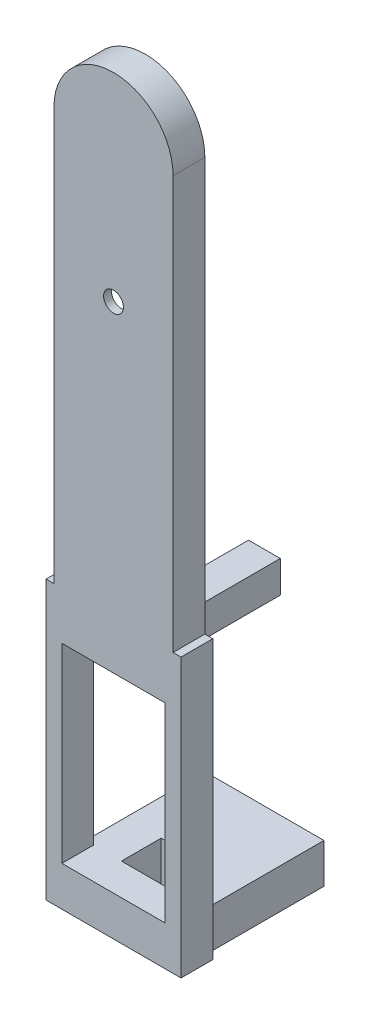
ISO-10303-21;
HEADER;
FILE_DESCRIPTION(('STEP AP214'),'2;1');
FILE_NAME('part.step','',(''),(''),'','','');
FILE_SCHEMA(('AUTOMOTIVE_DESIGN { 1 0 10303 214 1 1 1 1 }'));
ENDSEC;
DATA;
#1=APPLICATION_CONTEXT('core data for automotive mechanical design processes');
#2=APPLICATION_PROTOCOL_DEFINITION('international standard','automotive_design',2000,#1);
#3=PRODUCT_CONTEXT('',#1,'mechanical');
#4=PRODUCT('Part','Part','',(#3));
#5=PRODUCT_RELATED_PRODUCT_CATEGORY('part','',(#4));
#6=PRODUCT_DEFINITION_FORMATION('','',#4);
#7=PRODUCT_DEFINITION_CONTEXT('part definition',#1,'design');
#8=PRODUCT_DEFINITION('design','',#6,#7);
#9=PRODUCT_DEFINITION_SHAPE('','',#8);
#10=(LENGTH_UNIT() NAMED_UNIT(*) SI_UNIT(.MILLI.,.METRE.));
#11=(NAMED_UNIT(*) PLANE_ANGLE_UNIT() SI_UNIT($,.RADIAN.));
#12=(NAMED_UNIT(*) SI_UNIT($,.STERADIAN.) SOLID_ANGLE_UNIT());
#13=UNCERTAINTY_MEASURE_WITH_UNIT(LENGTH_MEASURE(1.E-05),#10,'distance_accuracy_value','');
#14=(GEOMETRIC_REPRESENTATION_CONTEXT(3) GLOBAL_UNCERTAINTY_ASSIGNED_CONTEXT((#13)) GLOBAL_UNIT_ASSIGNED_CONTEXT((#10,
#11,#12)) REPRESENTATION_CONTEXT('',''));
#15=CARTESIAN_POINT('',(0.,0.,0.));
#16=DIRECTION('',(0.,0.,1.));
#17=DIRECTION('',(1.,0.,0.));
#18=AXIS2_PLACEMENT_3D('',#15,#16,#17);
#19=CARTESIAN_POINT('',(0.,52.,0.));
#20=DIRECTION('',(0.,0.,1.));
#21=DIRECTION('',(1.,0.,0.));
#22=AXIS2_PLACEMENT_3D('',#19,#20,#21);
#23=PLANE('',#22);
#24=DIRECTION('',(1.,0.,0.));
#25=VECTOR('',#24,1.);
#26=CARTESIAN_POINT('',(-6.49999999999999,-30.,0.));
#27=LINE('',#26,#25);
#28=CARTESIAN_POINT('',(-3.,-30.,0.));
#29=VERTEX_POINT('',#28);
#30=CARTESIAN_POINT('',(3.,-30.,0.));
#31=VERTEX_POINT('',#30);
#32=EDGE_CURVE('E336',#29,#31,#27,.T.);
#33=ORIENTED_EDGE('',*,*,#32,.T.);
#34=DIRECTION('',(0.,-1.,0.));
#35=VECTOR('',#34,1.);
#36=CARTESIAN_POINT('',(3.,-30.,0.));
#37=LINE('',#36,#35);
#38=CARTESIAN_POINT('',(3.,-35.,0.));
#39=VERTEX_POINT('',#38);
#40=EDGE_CURVE('E257',#31,#39,#37,.T.);
#41=ORIENTED_EDGE('',*,*,#40,.T.);
#42=DIRECTION('',(1.,0.,0.));
#43=VECTOR('',#42,1.);
#44=CARTESIAN_POINT('',(8.50000000000001,-35.,0.));
#45=LINE('',#44,#43);
#46=CARTESIAN_POINT('',(-3.,-35.,0.));
#47=VERTEX_POINT('',#46);
#48=EDGE_CURVE('E392',#47,#39,#45,.T.);
#49=ORIENTED_EDGE('',*,*,#48,.F.);
#50=DIRECTION('',(0.,-1.,0.));
#51=VECTOR('',#50,1.);
#52=CARTESIAN_POINT('',(-3.,-30.,0.));
#53=LINE('',#52,#51);
#54=EDGE_CURVE('E292',#29,#47,#53,.T.);
#55=ORIENTED_EDGE('',*,*,#54,.F.);
#56=EDGE_LOOP('',(#33,#41,#49,#55));
#57=FACE_BOUND('',#56,.T.);
#58=ADVANCED_FACE('F36',(#57),#23,.F.);
#59=DIRECTION('',(-0.161684528353418,0.986842496699009,0.));
#60=VECTOR('',#59,1.);
#61=CARTESIAN_POINT('',(10.3740127119628,1.69968090964537,0.));
#62=LINE('',#61,#60);
#63=CARTESIAN_POINT('',(5.,34.5,0.));
#64=VERTEX_POINT('',#63);
#65=CARTESIAN_POINT('',(2.13279550115704,52.,0.));
#66=VERTEX_POINT('',#65);
#67=EDGE_CURVE('E413',#64,#66,#62,.T.);
#68=ORIENTED_EDGE('',*,*,#67,.T.);
#69=CARTESIAN_POINT('',(0.,52.,0.));
#70=DIRECTION('',(0.,0.,1.));
#71=DIRECTION('',(1.,0.,0.));
#72=AXIS2_PLACEMENT_3D('',#69,#70,#71);
#73=CIRCLE('',#72,2.13279550115703);
#74=CARTESIAN_POINT('',(-2.13279550115703,52.,0.));
#75=VERTEX_POINT('',#74);
#76=EDGE_CURVE('E408',#75,#66,#73,.F.);
#77=ORIENTED_EDGE('',*,*,#76,.F.);
#78=DIRECTION('',(-0.161684528353418,-0.986842496699009,0.));
#79=VECTOR('',#78,1.);
#80=CARTESIAN_POINT('',(-10.3740127119628,1.69968090964537,0.));
#81=LINE('',#80,#79);
#82=CARTESIAN_POINT('',(-5.,34.5,0.));
#83=VERTEX_POINT('',#82);
#84=EDGE_CURVE('E426',#75,#83,#81,.T.);
#85=ORIENTED_EDGE('',*,*,#84,.T.);
#86=DIRECTION('',(0.161167236733303,-0.986927110684346,0.));
#87=VECTOR('',#86,1.);
#88=CARTESIAN_POINT('',(0.617455268354402,0.100831721339679,0.));
#89=LINE('',#88,#87);
#90=CARTESIAN_POINT('',(-2.14221383494361,17.,0.));
#91=VERTEX_POINT('',#90);
#92=EDGE_CURVE('E429',#83,#91,#89,.T.);
#93=ORIENTED_EDGE('',*,*,#92,.T.);
#94=CARTESIAN_POINT('',(0.,17.,0.));
#95=DIRECTION('',(0.,0.,1.));
#96=DIRECTION('',(1.,0.,0.));
#97=AXIS2_PLACEMENT_3D('',#94,#95,#96);
#98=CIRCLE('',#97,2.14221383494361);
#99=CARTESIAN_POINT('',(2.11474128897981,16.6580213525557,0.));
#100=VERTEX_POINT('',#99);
#101=EDGE_CURVE('E432',#91,#100,#98,.T.);
#102=ORIENTED_EDGE('',*,*,#101,.T.);
#103=DIRECTION('',(-0.159637960443524,-0.987175628541057,0.));
#104=VECTOR('',#103,1.);
#105=CARTESIAN_POINT('',(-0.564300677997616,0.091254085603361,0.));
#106=LINE('',#105,#104);
#107=EDGE_CURVE('E435',#64,#100,#106,.T.);
#108=ORIENTED_EDGE('',*,*,#107,.F.);
#109=EDGE_LOOP('',(#68,#77,#85,#93,#102,#108));
#110=FACE_BOUND('',#109,.T.);
#111=DIRECTION('',(0.,-1.,0.));
#112=VECTOR('',#111,1.);
#113=CARTESIAN_POINT('',(7.5,-30.,0.));
#114=LINE('',#113,#112);
#115=CARTESIAN_POINT('',(7.5,-30.,0.));
#116=VERTEX_POINT('',#115);
#117=CARTESIAN_POINT('',(7.5,-35.,0.));
#118=VERTEX_POINT('',#117);
#119=EDGE_CURVE('E53',#116,#118,#114,.T.);
#120=ORIENTED_EDGE('',*,*,#119,.F.);
#121=DIRECTION('',(-1.,0.,0.));
#122=VECTOR('',#121,1.);
#123=CARTESIAN_POINT('',(0.,-30.,0.));
#124=LINE('',#123,#122);
#125=CARTESIAN_POINT('',(6.50000000000001,-30.,0.));
#126=VERTEX_POINT('',#125);
#127=EDGE_CURVE('E261',#116,#126,#124,.T.);
#128=ORIENTED_EDGE('',*,*,#127,.T.);
#129=DIRECTION('',(0.,1.,0.));
#130=VECTOR('',#129,1.);
#131=CARTESIAN_POINT('',(6.50000000000001,-6.,0.));
#132=LINE('',#131,#130);
#133=CARTESIAN_POINT('',(6.50000000000001,-6.,0.));
#134=VERTEX_POINT('',#133);
#135=EDGE_CURVE('E338',#126,#134,#132,.T.);
#136=ORIENTED_EDGE('',*,*,#135,.T.);
#137=DIRECTION('',(-1.,0.,0.));
#138=VECTOR('',#137,1.);
#139=CARTESIAN_POINT('',(-6.49999999999999,-6.,0.));
#140=LINE('',#139,#138);
#141=CARTESIAN_POINT('',(2.00000000000001,-6.00000000000001,0.));
#142=VERTEX_POINT('',#141);
#143=EDGE_CURVE('E342',#134,#142,#140,.T.);
#144=ORIENTED_EDGE('',*,*,#143,.T.);
#145=DIRECTION('',(0.,1.,0.));
#146=VECTOR('',#145,1.);
#147=CARTESIAN_POINT('',(2.00000000000001,-2.00000000000001,0.));
#148=LINE('',#147,#146);
#149=CARTESIAN_POINT('',(2.00000000000001,-2.00000000000001,0.));
#150=VERTEX_POINT('',#149);
#151=EDGE_CURVE('E304',#142,#150,#148,.T.);
#152=ORIENTED_EDGE('',*,*,#151,.T.);
#153=DIRECTION('',(-1.,0.,0.));
#154=VECTOR('',#153,1.);
#155=CARTESIAN_POINT('',(2.00000000000001,-2.00000000000001,0.));
#156=LINE('',#155,#154);
#157=CARTESIAN_POINT('',(-1.99999999999999,-2.00000000000001,0.));
#158=VERTEX_POINT('',#157);
#159=EDGE_CURVE('E322',#150,#158,#156,.T.);
#160=ORIENTED_EDGE('',*,*,#159,.T.);
#161=DIRECTION('',(0.,-1.,0.));
#162=VECTOR('',#161,1.);
#163=CARTESIAN_POINT('',(-1.99999999999999,-2.00000000000001,0.));
#164=LINE('',#163,#162);
#165=CARTESIAN_POINT('',(-1.99999999999999,-6.,0.));
#166=VERTEX_POINT('',#165);
#167=EDGE_CURVE('E310',#158,#166,#164,.T.);
#168=ORIENTED_EDGE('',*,*,#167,.T.);
#169=CARTESIAN_POINT('',(-6.49999999999999,-6.,0.));
#170=VERTEX_POINT('',#169);
#171=EDGE_CURVE('E341',#166,#170,#140,.T.);
#172=ORIENTED_EDGE('',*,*,#171,.T.);
#173=DIRECTION('',(0.,-1.,0.));
#174=VECTOR('',#173,1.);
#175=CARTESIAN_POINT('',(-6.49999999999999,-6.,0.));
#176=LINE('',#175,#174);
#177=CARTESIAN_POINT('',(-6.49999999999999,-30.,0.));
#178=VERTEX_POINT('',#177);
#179=EDGE_CURVE('E329',#170,#178,#176,.T.);
#180=ORIENTED_EDGE('',*,*,#179,.T.);
#181=DIRECTION('',(-1.,0.,0.));
#182=VECTOR('',#181,1.);
#183=CARTESIAN_POINT('',(0.,-30.,0.));
#184=LINE('',#183,#182);
#185=CARTESIAN_POINT('',(-7.5,-30.,0.));
#186=VERTEX_POINT('',#185);
#187=EDGE_CURVE('E60',#178,#186,#184,.T.);
#188=ORIENTED_EDGE('',*,*,#187,.T.);
#189=DIRECTION('',(0.,-1.,0.));
#190=VECTOR('',#189,1.);
#191=CARTESIAN_POINT('',(-7.5,-30.,0.));
#192=LINE('',#191,#190);
#193=CARTESIAN_POINT('',(-7.5,-35.,0.));
#194=VERTEX_POINT('',#193);
#195=EDGE_CURVE('E295',#186,#194,#192,.T.);
#196=ORIENTED_EDGE('',*,*,#195,.T.);
#197=CARTESIAN_POINT('',(-8.49999999999999,-35.,0.));
#198=VERTEX_POINT('',#197);
#199=EDGE_CURVE('E372',#198,#194,#45,.T.);
#200=ORIENTED_EDGE('',*,*,#199,.F.);
#201=DIRECTION('',(0.,-1.,0.));
#202=VECTOR('',#201,1.);
#203=CARTESIAN_POINT('',(-8.49999999999999,0.,0.));
#204=LINE('',#203,#202);
#205=CARTESIAN_POINT('',(-8.49999999999999,0.,0.));
#206=VERTEX_POINT('',#205);
#207=EDGE_CURVE('E387',#206,#198,#204,.T.);
#208=ORIENTED_EDGE('',*,*,#207,.F.);
#209=DIRECTION('',(-1.,0.,0.));
#210=VECTOR('',#209,1.);
#211=CARTESIAN_POINT('',(8.50000000000001,0.,0.));
#212=LINE('',#211,#210);
#213=CARTESIAN_POINT('',(-7.5,0.,0.));
#214=VERTEX_POINT('',#213);
#215=EDGE_CURVE('E383',#214,#206,#212,.T.);
#216=ORIENTED_EDGE('',*,*,#215,.F.);
#217=DIRECTION('',(0.,-1.,0.));
#218=VECTOR('',#217,1.);
#219=CARTESIAN_POINT('',(-7.5,0.,0.));
#220=LINE('',#219,#218);
#221=CARTESIAN_POINT('',(-7.5,52.,0.));
#222=VERTEX_POINT('',#221);
#223=EDGE_CURVE('E456',#222,#214,#220,.T.);
#224=ORIENTED_EDGE('',*,*,#223,.F.);
#225=CARTESIAN_POINT('',(0.,52.,0.));
#226=DIRECTION('',(0.,0.,1.));
#227=DIRECTION('',(1.,0.,0.));
#228=AXIS2_PLACEMENT_3D('',#225,#226,#227);
#229=CIRCLE('',#228,7.5);
#230=CARTESIAN_POINT('',(7.5,52.,0.));
#231=VERTEX_POINT('',#230);
#232=EDGE_CURVE('E462',#231,#222,#229,.T.);
#233=ORIENTED_EDGE('',*,*,#232,.F.);
#234=DIRECTION('',(0.,1.,0.));
#235=VECTOR('',#234,1.);
#236=CARTESIAN_POINT('',(7.5,0.,0.));
#237=LINE('',#236,#235);
#238=CARTESIAN_POINT('',(7.5,0.,0.));
#239=VERTEX_POINT('',#238);
#240=EDGE_CURVE('E452',#239,#231,#237,.T.);
#241=ORIENTED_EDGE('',*,*,#240,.F.);
#242=CARTESIAN_POINT('',(8.50000000000001,0.,0.));
#243=VERTEX_POINT('',#242);
#244=EDGE_CURVE('E384',#243,#239,#212,.T.);
#245=ORIENTED_EDGE('',*,*,#244,.F.);
#246=DIRECTION('',(0.,1.,0.));
#247=VECTOR('',#246,1.);
#248=CARTESIAN_POINT('',(8.50000000000001,0.,0.));
#249=LINE('',#248,#247);
#250=CARTESIAN_POINT('',(8.50000000000001,-35.,0.));
#251=VERTEX_POINT('',#250);
#252=EDGE_CURVE('E367',#251,#243,#249,.T.);
#253=ORIENTED_EDGE('',*,*,#252,.F.);
#254=EDGE_CURVE('E389',#118,#251,#45,.T.);
#255=ORIENTED_EDGE('',*,*,#254,.F.);
#256=EDGE_LOOP('',(#120,#128,#136,#144,#152,#160,#168,#172,#180,#188,#196,#200,#208,#216,#224,
#233,#241,#245,#253,#255));
#257=FACE_BOUND('',#256,.T.);
#258=ADVANCED_FACE('F498',(#110,#257),#23,.F.);
#259=CARTESIAN_POINT('',(0.,52.,4.));
#260=DIRECTION('',(0.,0.,1.));
#261=DIRECTION('',(1.,0.,0.));
#262=AXIS2_PLACEMENT_3D('',#259,#260,#261);
#263=PLANE('',#262);
#264=CARTESIAN_POINT('',(0.,34.5,4.));
#265=DIRECTION('',(0.,0.,1.));
#266=DIRECTION('',(1.,0.,0.));
#267=AXIS2_PLACEMENT_3D('',#264,#265,#266);
#268=CIRCLE('',#267,1.25);
#269=CARTESIAN_POINT('',(1.25,34.5,4.));
#270=VERTEX_POINT('',#269);
#271=EDGE_CURVE('E405',#270,#270,#268,.F.);
#272=ORIENTED_EDGE('',*,*,#271,.T.);
#273=EDGE_LOOP('',(#272));
#274=FACE_BOUND('',#273,.T.);
#275=DIRECTION('',(0.,-1.,0.));
#276=VECTOR('',#275,1.);
#277=CARTESIAN_POINT('',(-7.5,0.,4.));
#278=LINE('',#277,#276);
#279=CARTESIAN_POINT('',(-7.5,52.,4.));
#280=VERTEX_POINT('',#279);
#281=CARTESIAN_POINT('',(-7.5,0.,4.));
#282=VERTEX_POINT('',#281);
#283=EDGE_CURVE('E458',#280,#282,#278,.T.);
#284=ORIENTED_EDGE('',*,*,#283,.T.);
#285=DIRECTION('',(-1.,0.,0.));
#286=VECTOR('',#285,1.);
#287=CARTESIAN_POINT('',(8.50000000000001,0.,4.));
#288=LINE('',#287,#286);
#289=CARTESIAN_POINT('',(-8.49999999999999,0.,4.));
#290=VERTEX_POINT('',#289);
#291=EDGE_CURVE('E371',#282,#290,#288,.T.);
#292=ORIENTED_EDGE('',*,*,#291,.T.);
#293=DIRECTION('',(0.,-1.,0.));
#294=VECTOR('',#293,1.);
#295=CARTESIAN_POINT('',(-8.49999999999999,0.,4.));
#296=LINE('',#295,#294);
#297=CARTESIAN_POINT('',(-8.49999999999999,-35.,4.));
#298=VERTEX_POINT('',#297);
#299=EDGE_CURVE('E376',#290,#298,#296,.T.);
#300=ORIENTED_EDGE('',*,*,#299,.T.);
#301=DIRECTION('',(1.,0.,0.));
#302=VECTOR('',#301,1.);
#303=CARTESIAN_POINT('',(8.50000000000001,-35.,4.));
#304=LINE('',#303,#302);
#305=CARTESIAN_POINT('',(8.50000000000001,-35.,4.));
#306=VERTEX_POINT('',#305);
#307=EDGE_CURVE('E378',#298,#306,#304,.T.);
#308=ORIENTED_EDGE('',*,*,#307,.T.);
#309=DIRECTION('',(0.,1.,0.));
#310=VECTOR('',#309,1.);
#311=CARTESIAN_POINT('',(8.50000000000001,0.,4.));
#312=LINE('',#311,#310);
#313=CARTESIAN_POINT('',(8.50000000000001,0.,4.));
#314=VERTEX_POINT('',#313);
#315=EDGE_CURVE('E368',#306,#314,#312,.T.);
#316=ORIENTED_EDGE('',*,*,#315,.T.);
#317=CARTESIAN_POINT('',(7.5,0.,4.));
#318=VERTEX_POINT('',#317);
#319=EDGE_CURVE('E373',#314,#318,#288,.T.);
#320=ORIENTED_EDGE('',*,*,#319,.T.);
#321=DIRECTION('',(0.,1.,0.));
#322=VECTOR('',#321,1.);
#323=CARTESIAN_POINT('',(7.5,0.,4.));
#324=LINE('',#323,#322);
#325=CARTESIAN_POINT('',(7.5,52.,4.));
#326=VERTEX_POINT('',#325);
#327=EDGE_CURVE('E453',#318,#326,#324,.T.);
#328=ORIENTED_EDGE('',*,*,#327,.T.);
#329=CARTESIAN_POINT('',(0.,52.,4.));
#330=DIRECTION('',(0.,0.,1.));
#331=DIRECTION('',(1.,0.,0.));
#332=AXIS2_PLACEMENT_3D('',#329,#330,#331);
#333=CIRCLE('',#332,7.5);
#334=EDGE_CURVE('E455',#326,#280,#333,.T.);
#335=ORIENTED_EDGE('',*,*,#334,.T.);
#336=EDGE_LOOP('',(#284,#292,#300,#308,#316,#320,#328,#335));
#337=FACE_BOUND('',#336,.T.);
#338=DIRECTION('',(-1.,0.,0.));
#339=VECTOR('',#338,1.);
#340=CARTESIAN_POINT('',(0.,-30.,4.));
#341=LINE('',#340,#339);
#342=CARTESIAN_POINT('',(6.50000000000001,-30.,4.));
#343=VERTEX_POINT('',#342);
#344=CARTESIAN_POINT('',(-6.49999999999999,-30.,4.));
#345=VERTEX_POINT('',#344);
#346=EDGE_CURVE('E361',#343,#345,#341,.T.);
#347=ORIENTED_EDGE('',*,*,#346,.T.);
#348=DIRECTION('',(0.,1.,0.));
#349=VECTOR('',#348,1.);
#350=CARTESIAN_POINT('',(-6.5,52.,4.));
#351=LINE('',#350,#349);
#352=CARTESIAN_POINT('',(-6.49999999999999,-6.,4.));
#353=VERTEX_POINT('',#352);
#354=EDGE_CURVE('E364',#345,#353,#351,.T.);
#355=ORIENTED_EDGE('',*,*,#354,.T.);
#356=DIRECTION('',(1.,0.,0.));
#357=VECTOR('',#356,1.);
#358=CARTESIAN_POINT('',(0.,-6.,4.));
#359=LINE('',#358,#357);
#360=CARTESIAN_POINT('',(6.50000000000001,-6.,4.));
#361=VERTEX_POINT('',#360);
#362=EDGE_CURVE('E355',#353,#361,#359,.T.);
#363=ORIENTED_EDGE('',*,*,#362,.T.);
#364=DIRECTION('',(0.,-1.,0.));
#365=VECTOR('',#364,1.);
#366=CARTESIAN_POINT('',(6.5,52.,4.));
#367=LINE('',#366,#365);
#368=EDGE_CURVE('E358',#361,#343,#367,.T.);
#369=ORIENTED_EDGE('',*,*,#368,.T.);
#370=EDGE_LOOP('',(#347,#355,#363,#369));
#371=FACE_BOUND('',#370,.T.);
#372=ADVANCED_FACE('F529',(#274,#337,#371),#263,.T.);
#373=CARTESIAN_POINT('',(7.5,0.,4.));
#374=DIRECTION('',(-1.,0.,0.));
#375=DIRECTION('',(0.,0.,1.));
#376=AXIS2_PLACEMENT_3D('',#373,#374,#375);
#377=PLANE('',#376);
#378=ORIENTED_EDGE('',*,*,#240,.T.);
#379=DIRECTION('',(0.,0.,-1.));
#380=VECTOR('',#379,1.);
#381=CARTESIAN_POINT('',(7.5,52.,4.));
#382=LINE('',#381,#380);
#383=EDGE_CURVE('E470',#326,#231,#382,.T.);
#384=ORIENTED_EDGE('',*,*,#383,.F.);
#385=ORIENTED_EDGE('',*,*,#327,.F.);
#386=DIRECTION('',(0.,0.,-1.));
#387=VECTOR('',#386,1.);
#388=CARTESIAN_POINT('',(7.5,0.,4.));
#389=LINE('',#388,#387);
#390=EDGE_CURVE('E45',#318,#239,#389,.T.);
#391=ORIENTED_EDGE('',*,*,#390,.T.);
#392=EDGE_LOOP('',(#378,#384,#385,#391));
#393=FACE_BOUND('',#392,.T.);
#394=ADVANCED_FACE('F38',(#393),#377,.F.);
#395=CARTESIAN_POINT('',(0.,52.,4.));
#396=DIRECTION('',(0.,0.,-1.));
#397=DIRECTION('',(-1.,0.,0.));
#398=AXIS2_PLACEMENT_3D('',#395,#396,#397);
#399=CYLINDRICAL_SURFACE('',#398,7.5);
#400=ORIENTED_EDGE('',*,*,#232,.T.);
#401=DIRECTION('',(0.,0.,-1.));
#402=VECTOR('',#401,1.);
#403=CARTESIAN_POINT('',(-7.5,52.,4.));
#404=LINE('',#403,#402);
#405=EDGE_CURVE('E467',#280,#222,#404,.T.);
#406=ORIENTED_EDGE('',*,*,#405,.F.);
#407=ORIENTED_EDGE('',*,*,#334,.F.);
#408=ORIENTED_EDGE('',*,*,#383,.T.);
#409=EDGE_LOOP('',(#400,#406,#407,#408));
#410=FACE_BOUND('',#409,.T.);
#411=ADVANCED_FACE('F713',(#410),#399,.T.);
#412=CARTESIAN_POINT('',(-7.5,0.,4.));
#413=DIRECTION('',(1.,0.,0.));
#414=DIRECTION('',(0.,0.,-1.));
#415=AXIS2_PLACEMENT_3D('',#412,#413,#414);
#416=PLANE('',#415);
#417=ORIENTED_EDGE('',*,*,#223,.T.);
#418=DIRECTION('',(0.,0.,-1.));
#419=VECTOR('',#418,1.);
#420=CARTESIAN_POINT('',(-7.5,0.,4.));
#421=LINE('',#420,#419);
#422=EDGE_CURVE('E460',#282,#214,#421,.T.);
#423=ORIENTED_EDGE('',*,*,#422,.F.);
#424=ORIENTED_EDGE('',*,*,#283,.F.);
#425=ORIENTED_EDGE('',*,*,#405,.T.);
#426=EDGE_LOOP('',(#417,#423,#424,#425));
#427=FACE_BOUND('',#426,.T.);
#428=ADVANCED_FACE('F520',(#427),#416,.F.);
#429=CARTESIAN_POINT('',(0.,52.,3.));
#430=DIRECTION('',(0.,0.,-1.));
#431=DIRECTION('',(-1.,0.,0.));
#432=AXIS2_PLACEMENT_3D('',#429,#430,#431);
#433=CYLINDRICAL_SURFACE('',#432,2.13279550115703);
#434=ORIENTED_EDGE('',*,*,#76,.T.);
#435=DIRECTION('',(0.,0.,-1.));
#436=VECTOR('',#435,1.);
#437=CARTESIAN_POINT('',(2.13279550115704,52.,3.));
#438=LINE('',#437,#436);
#439=CARTESIAN_POINT('',(2.13279550115704,52.,3.));
#440=VERTEX_POINT('',#439);
#441=EDGE_CURVE('E424',#440,#66,#438,.T.);
#442=ORIENTED_EDGE('',*,*,#441,.F.);
#443=CARTESIAN_POINT('',(0.,52.,3.));
#444=DIRECTION('',(0.,0.,1.));
#445=DIRECTION('',(1.,0.,0.));
#446=AXIS2_PLACEMENT_3D('',#443,#444,#445);
#447=CIRCLE('',#446,2.13279550115703);
#448=CARTESIAN_POINT('',(-2.13279550115703,52.,3.));
#449=VERTEX_POINT('',#448);
#450=EDGE_CURVE('E409',#449,#440,#447,.F.);
#451=ORIENTED_EDGE('',*,*,#450,.F.);
#452=DIRECTION('',(0.,0.,-1.));
#453=VECTOR('',#452,1.);
#454=CARTESIAN_POINT('',(-2.13279550115703,52.,3.));
#455=LINE('',#454,#453);
#456=EDGE_CURVE('E450',#449,#75,#455,.T.);
#457=ORIENTED_EDGE('',*,*,#456,.T.);
#458=EDGE_LOOP('',(#434,#442,#451,#457));
#459=FACE_BOUND('',#458,.T.);
#460=ADVANCED_FACE('F491',(#459),#433,.F.);
#461=CARTESIAN_POINT('',(-10.3740127119628,1.69968090964537,3.));
#462=DIRECTION('',(0.986842496699008,-0.161684528353418,0.));
#463=DIRECTION('',(0.161684528353418,0.986842496699009,0.));
#464=AXIS2_PLACEMENT_3D('',#461,#462,#463);
#465=PLANE('',#464);
#466=ORIENTED_EDGE('',*,*,#84,.F.);
#467=ORIENTED_EDGE('',*,*,#456,.F.);
#468=DIRECTION('',(-0.161684528353418,-0.986842496699009,0.));
#469=VECTOR('',#468,1.);
#470=CARTESIAN_POINT('',(-10.3740127119628,1.69968090964537,3.));
#471=LINE('',#470,#469);
#472=CARTESIAN_POINT('',(-5.,34.5,3.));
#473=VERTEX_POINT('',#472);
#474=EDGE_CURVE('E412',#449,#473,#471,.T.);
#475=ORIENTED_EDGE('',*,*,#474,.T.);
#476=DIRECTION('',(0.,0.,-1.));
#477=VECTOR('',#476,1.);
#478=CARTESIAN_POINT('',(-5.,34.5,3.));
#479=LINE('',#478,#477);
#480=EDGE_CURVE('E448',#473,#83,#479,.T.);
#481=ORIENTED_EDGE('',*,*,#480,.T.);
#482=EDGE_LOOP('',(#466,#467,#475,#481));
#483=FACE_BOUND('',#482,.T.);
#484=ADVANCED_FACE('F512',(#483),#465,.T.);
#485=CARTESIAN_POINT('',(0.617455268354402,0.100831721339679,3.));
#486=DIRECTION('',(0.986927110684346,0.161167236733303,0.));
#487=DIRECTION('',(-0.161167236733303,0.986927110684346,0.));
#488=AXIS2_PLACEMENT_3D('',#485,#486,#487);
#489=PLANE('',#488);
#490=ORIENTED_EDGE('',*,*,#92,.F.);
#491=ORIENTED_EDGE('',*,*,#480,.F.);
#492=DIRECTION('',(0.161167236733303,-0.986927110684346,0.));
#493=VECTOR('',#492,1.);
#494=CARTESIAN_POINT('',(0.617455268354402,0.100831721339679,3.));
#495=LINE('',#494,#493);
#496=CARTESIAN_POINT('',(-2.14221383494361,17.,3.));
#497=VERTEX_POINT('',#496);
#498=EDGE_CURVE('E415',#473,#497,#495,.T.);
#499=ORIENTED_EDGE('',*,*,#498,.T.);
#500=DIRECTION('',(0.,0.,-1.));
#501=VECTOR('',#500,1.);
#502=CARTESIAN_POINT('',(-2.14221383494361,17.,3.));
#503=LINE('',#502,#501);
#504=EDGE_CURVE('E446',#497,#91,#503,.T.);
#505=ORIENTED_EDGE('',*,*,#504,.T.);
#506=EDGE_LOOP('',(#490,#491,#499,#505));
#507=FACE_BOUND('',#506,.T.);
#508=ADVANCED_FACE('F509',(#507),#489,.T.);
#509=CARTESIAN_POINT('',(0.,17.,3.));
#510=DIRECTION('',(0.,0.,-1.));
#511=DIRECTION('',(-1.,0.,0.));
#512=AXIS2_PLACEMENT_3D('',#509,#510,#511);
#513=CYLINDRICAL_SURFACE('',#512,2.14221383494361);
#514=ORIENTED_EDGE('',*,*,#101,.F.);
#515=ORIENTED_EDGE('',*,*,#504,.F.);
#516=CARTESIAN_POINT('',(0.,17.,3.));
#517=DIRECTION('',(0.,0.,1.));
#518=DIRECTION('',(1.,0.,0.));
#519=AXIS2_PLACEMENT_3D('',#516,#517,#518);
#520=CIRCLE('',#519,2.14221383494361);
#521=CARTESIAN_POINT('',(2.11474128897981,16.6580213525557,3.));
#522=VERTEX_POINT('',#521);
#523=EDGE_CURVE('E417',#497,#522,#520,.T.);
#524=ORIENTED_EDGE('',*,*,#523,.T.);
#525=DIRECTION('',(0.,0.,-1.));
#526=VECTOR('',#525,1.);
#527=CARTESIAN_POINT('',(2.11474128897981,16.6580213525557,3.));
#528=LINE('',#527,#526);
#529=EDGE_CURVE('E444',#522,#100,#528,.T.);
#530=ORIENTED_EDGE('',*,*,#529,.T.);
#531=EDGE_LOOP('',(#514,#515,#524,#530));
#532=FACE_BOUND('',#531,.T.);
#533=ADVANCED_FACE('F506',(#532),#513,.F.);
#534=CARTESIAN_POINT('',(-0.564300677997616,0.091254085603361,3.));
#535=DIRECTION('',(0.987175628541057,-0.159637960443524,0.));
#536=DIRECTION('',(0.159637960443524,0.987175628541057,0.));
#537=AXIS2_PLACEMENT_3D('',#534,#535,#536);
#538=PLANE('',#537);
#539=ORIENTED_EDGE('',*,*,#107,.T.);
#540=ORIENTED_EDGE('',*,*,#529,.F.);
#541=DIRECTION('',(-0.159637960443524,-0.987175628541057,0.));
#542=VECTOR('',#541,1.);
#543=CARTESIAN_POINT('',(-0.564300677997616,0.091254085603361,3.));
#544=LINE('',#543,#542);
#545=CARTESIAN_POINT('',(5.,34.5,3.));
#546=VERTEX_POINT('',#545);
#547=EDGE_CURVE('E419',#546,#522,#544,.T.);
#548=ORIENTED_EDGE('',*,*,#547,.F.);
#549=DIRECTION('',(0.,0.,-1.));
#550=VECTOR('',#549,1.);
#551=CARTESIAN_POINT('',(5.,34.5,3.));
#552=LINE('',#551,#550);
#553=EDGE_CURVE('E442',#546,#64,#552,.T.);
#554=ORIENTED_EDGE('',*,*,#553,.T.);
#555=EDGE_LOOP('',(#539,#540,#548,#554));
#556=FACE_BOUND('',#555,.T.);
#557=ADVANCED_FACE('F502',(#556),#538,.F.);
#558=CARTESIAN_POINT('',(10.3740127119628,1.69968090964537,3.));
#559=DIRECTION('',(-0.986842496699008,-0.161684528353418,0.));
#560=DIRECTION('',(0.161684528353418,-0.986842496699009,0.));
#561=AXIS2_PLACEMENT_3D('',#558,#559,#560);
#562=PLANE('',#561);
#563=ORIENTED_EDGE('',*,*,#67,.F.);
#564=ORIENTED_EDGE('',*,*,#553,.F.);
#565=DIRECTION('',(-0.161684528353418,0.986842496699009,0.));
#566=VECTOR('',#565,1.);
#567=CARTESIAN_POINT('',(10.3740127119628,1.69968090964537,3.));
#568=LINE('',#567,#566);
#569=EDGE_CURVE('E422',#546,#440,#568,.T.);
#570=ORIENTED_EDGE('',*,*,#569,.T.);
#571=ORIENTED_EDGE('',*,*,#441,.T.);
#572=EDGE_LOOP('',(#563,#564,#570,#571));
#573=FACE_BOUND('',#572,.T.);
#574=ADVANCED_FACE('F482',(#573),#562,.T.);
#575=CARTESIAN_POINT('',(0.,0.,3.));
#576=DIRECTION('',(0.,0.,1.));
#577=DIRECTION('',(1.,0.,0.));
#578=AXIS2_PLACEMENT_3D('',#575,#576,#577);
#579=PLANE('',#578);
#580=CARTESIAN_POINT('',(0.,34.5,3.));
#581=DIRECTION('',(0.,0.,1.));
#582=DIRECTION('',(1.,0.,0.));
#583=AXIS2_PLACEMENT_3D('',#580,#581,#582);
#584=CIRCLE('',#583,1.25);
#585=CARTESIAN_POINT('',(1.25,34.5,3.));
#586=VERTEX_POINT('',#585);
#587=EDGE_CURVE('E404',#586,#586,#584,.F.);
#588=ORIENTED_EDGE('',*,*,#587,.F.);
#589=EDGE_LOOP('',(#588));
#590=FACE_BOUND('',#589,.T.);
#591=ORIENTED_EDGE('',*,*,#450,.T.);
#592=ORIENTED_EDGE('',*,*,#569,.F.);
#593=ORIENTED_EDGE('',*,*,#547,.T.);
#594=ORIENTED_EDGE('',*,*,#523,.F.);
#595=ORIENTED_EDGE('',*,*,#498,.F.);
#596=ORIENTED_EDGE('',*,*,#474,.F.);
#597=EDGE_LOOP('',(#591,#592,#593,#594,#595,#596));
#598=FACE_BOUND('',#597,.T.);
#599=ADVANCED_FACE('F479',(#590,#598),#579,.F.);
#600=CARTESIAN_POINT('',(0.,34.5,12.4));
#601=DIRECTION('',(0.,0.,-1.));
#602=DIRECTION('',(-1.,0.,0.));
#603=AXIS2_PLACEMENT_3D('',#600,#601,#602);
#604=CYLINDRICAL_SURFACE('',#603,1.25);
#605=ORIENTED_EDGE('',*,*,#271,.F.);
#606=EDGE_LOOP('',(#605));
#607=FACE_BOUND('',#606,.T.);
#608=ORIENTED_EDGE('',*,*,#587,.T.);
#609=EDGE_LOOP('',(#608));
#610=FACE_BOUND('',#609,.T.);
#611=ADVANCED_FACE('F477',(#607,#610),#604,.F.);
#612=CARTESIAN_POINT('',(8.50000000000001,0.,4.));
#613=DIRECTION('',(0.,-1.,0.));
#614=DIRECTION('',(1.,0.,0.));
#615=AXIS2_PLACEMENT_3D('',#612,#613,#614);
#616=PLANE('',#615);
#617=ORIENTED_EDGE('',*,*,#291,.F.);
#618=ORIENTED_EDGE('',*,*,#422,.T.);
#619=ORIENTED_EDGE('',*,*,#215,.T.);
#620=DIRECTION('',(0.,0.,-1.));
#621=VECTOR('',#620,1.);
#622=CARTESIAN_POINT('',(-8.49999999999999,0.,4.));
#623=LINE('',#622,#621);
#624=EDGE_CURVE('E398',#290,#206,#623,.T.);
#625=ORIENTED_EDGE('',*,*,#624,.F.);
#626=EDGE_LOOP('',(#617,#618,#619,#625));
#627=FACE_BOUND('',#626,.T.);
#628=ADVANCED_FACE('F594',(#627),#616,.F.);
#629=CARTESIAN_POINT('',(8.50000000000001,0.,4.));
#630=DIRECTION('',(-1.,0.,0.));
#631=DIRECTION('',(0.,-1.,0.));
#632=AXIS2_PLACEMENT_3D('',#629,#630,#631);
#633=PLANE('',#632);
#634=ORIENTED_EDGE('',*,*,#252,.T.);
#635=DIRECTION('',(0.,0.,-1.));
#636=VECTOR('',#635,1.);
#637=CARTESIAN_POINT('',(8.50000000000001,0.,4.));
#638=LINE('',#637,#636);
#639=EDGE_CURVE('E401',#314,#243,#638,.T.);
#640=ORIENTED_EDGE('',*,*,#639,.F.);
#641=ORIENTED_EDGE('',*,*,#315,.F.);
#642=DIRECTION('',(0.,0.,-1.));
#643=VECTOR('',#642,1.);
#644=CARTESIAN_POINT('',(8.50000000000001,-35.,4.));
#645=LINE('',#644,#643);
#646=EDGE_CURVE('E380',#306,#251,#645,.T.);
#647=ORIENTED_EDGE('',*,*,#646,.T.);
#648=EDGE_LOOP('',(#634,#640,#641,#647));
#649=FACE_BOUND('',#648,.T.);
#650=ADVANCED_FACE('F592',(#649),#633,.F.);
#651=ORIENTED_EDGE('',*,*,#390,.F.);
#652=ORIENTED_EDGE('',*,*,#319,.F.);
#653=ORIENTED_EDGE('',*,*,#639,.T.);
#654=ORIENTED_EDGE('',*,*,#244,.T.);
#655=EDGE_LOOP('',(#651,#652,#653,#654));
#656=FACE_BOUND('',#655,.T.);
#657=ADVANCED_FACE('F588',(#656),#616,.F.);
#658=CARTESIAN_POINT('',(-8.49999999999999,0.,4.));
#659=DIRECTION('',(1.,0.,0.));
#660=DIRECTION('',(0.,1.,0.));
#661=AXIS2_PLACEMENT_3D('',#658,#659,#660);
#662=PLANE('',#661);
#663=ORIENTED_EDGE('',*,*,#207,.T.);
#664=DIRECTION('',(0.,0.,-1.));
#665=VECTOR('',#664,1.);
#666=CARTESIAN_POINT('',(-8.49999999999999,-35.,4.));
#667=LINE('',#666,#665);
#668=EDGE_CURVE('E395',#298,#198,#667,.T.);
#669=ORIENTED_EDGE('',*,*,#668,.F.);
#670=ORIENTED_EDGE('',*,*,#299,.F.);
#671=ORIENTED_EDGE('',*,*,#624,.T.);
#672=EDGE_LOOP('',(#663,#669,#670,#671));
#673=FACE_BOUND('',#672,.T.);
#674=ADVANCED_FACE('F584',(#673),#662,.F.);
#675=CARTESIAN_POINT('',(8.50000000000001,-35.,4.));
#676=DIRECTION('',(0.,1.,0.));
#677=DIRECTION('',(0.,0.,1.));
#678=AXIS2_PLACEMENT_3D('',#675,#676,#677);
#679=PLANE('',#678);
#680=ORIENTED_EDGE('',*,*,#48,.T.);
#681=DIRECTION('',(0.,0.,-1.));
#682=VECTOR('',#681,1.);
#683=CARTESIAN_POINT('',(3.,-35.,0.));
#684=LINE('',#683,#682);
#685=CARTESIAN_POINT('',(3.,-35.,-5.));
#686=VERTEX_POINT('',#685);
#687=EDGE_CURVE('E278',#39,#686,#684,.T.);
#688=ORIENTED_EDGE('',*,*,#687,.T.);
#689=DIRECTION('',(1.,0.,0.));
#690=VECTOR('',#689,1.);
#691=CARTESIAN_POINT('',(0.,-35.,-5.));
#692=LINE('',#691,#690);
#693=CARTESIAN_POINT('',(-3.,-35.,-5.));
#694=VERTEX_POINT('',#693);
#695=EDGE_CURVE('E252',#694,#686,#692,.T.);
#696=ORIENTED_EDGE('',*,*,#695,.F.);
#697=DIRECTION('',(0.,0.,-1.));
#698=VECTOR('',#697,1.);
#699=CARTESIAN_POINT('',(-3.,-35.,0.));
#700=LINE('',#699,#698);
#701=EDGE_CURVE('E246',#47,#694,#700,.T.);
#702=ORIENTED_EDGE('',*,*,#701,.F.);
#703=EDGE_LOOP('',(#680,#688,#696,#702));
#704=FACE_BOUND('',#703,.T.);
#705=ORIENTED_EDGE('',*,*,#199,.T.);
#706=DIRECTION('',(0.,0.,-1.));
#707=VECTOR('',#706,1.);
#708=CARTESIAN_POINT('',(-7.5,-35.,0.));
#709=LINE('',#708,#707);
#710=CARTESIAN_POINT('',(-7.5,-35.,-15.));
#711=VERTEX_POINT('',#710);
#712=EDGE_CURVE('E287',#194,#711,#709,.T.);
#713=ORIENTED_EDGE('',*,*,#712,.T.);
#714=DIRECTION('',(1.,0.,0.));
#715=VECTOR('',#714,1.);
#716=CARTESIAN_POINT('',(0.,-35.,-15.));
#717=LINE('',#716,#715);
#718=CARTESIAN_POINT('',(7.5,-35.,-15.));
#719=VERTEX_POINT('',#718);
#720=EDGE_CURVE('E284',#711,#719,#717,.T.);
#721=ORIENTED_EDGE('',*,*,#720,.T.);
#722=DIRECTION('',(0.,0.,-1.));
#723=VECTOR('',#722,1.);
#724=CARTESIAN_POINT('',(7.5,-35.,0.));
#725=LINE('',#724,#723);
#726=EDGE_CURVE('E281',#118,#719,#725,.T.);
#727=ORIENTED_EDGE('',*,*,#726,.F.);
#728=ORIENTED_EDGE('',*,*,#254,.T.);
#729=ORIENTED_EDGE('',*,*,#646,.F.);
#730=ORIENTED_EDGE('',*,*,#307,.F.);
#731=ORIENTED_EDGE('',*,*,#668,.T.);
#732=EDGE_LOOP('',(#705,#713,#721,#727,#728,#729,#730,#731));
#733=FACE_BOUND('',#732,.T.);
#734=ADVANCED_FACE('F580',(#704,#733),#679,.F.);
#735=CARTESIAN_POINT('',(-6.49999999999999,-6.,12.1));
#736=DIRECTION('',(1.,0.,0.));
#737=DIRECTION('',(0.,1.,0.));
#738=AXIS2_PLACEMENT_3D('',#735,#736,#737);
#739=PLANE('',#738);
#740=DIRECTION('',(0.,0.,-1.));
#741=VECTOR('',#740,1.);
#742=CARTESIAN_POINT('',(-6.49999999999999,-30.,12.1));
#743=LINE('',#742,#741);
#744=EDGE_CURVE('E353',#345,#178,#743,.T.);
#745=ORIENTED_EDGE('',*,*,#744,.T.);
#746=ORIENTED_EDGE('',*,*,#179,.F.);
#747=DIRECTION('',(0.,0.,-1.));
#748=VECTOR('',#747,1.);
#749=CARTESIAN_POINT('',(-6.49999999999999,-6.,12.1));
#750=LINE('',#749,#748);
#751=EDGE_CURVE('E345',#353,#170,#750,.T.);
#752=ORIENTED_EDGE('',*,*,#751,.F.);
#753=ORIENTED_EDGE('',*,*,#354,.F.);
#754=EDGE_LOOP('',(#745,#746,#752,#753));
#755=FACE_BOUND('',#754,.T.);
#756=ADVANCED_FACE('F576',(#755),#739,.T.);
#757=CARTESIAN_POINT('',(-6.49999999999999,-30.,12.1));
#758=DIRECTION('',(0.,1.,0.));
#759=DIRECTION('',(0.,0.,1.));
#760=AXIS2_PLACEMENT_3D('',#757,#758,#759);
#761=PLANE('',#760);
#762=DIRECTION('',(0.,0.,-1.));
#763=VECTOR('',#762,1.);
#764=CARTESIAN_POINT('',(6.50000000000001,-30.,12.1));
#765=LINE('',#764,#763);
#766=EDGE_CURVE('E350',#343,#126,#765,.T.);
#767=ORIENTED_EDGE('',*,*,#766,.T.);
#768=ORIENTED_EDGE('',*,*,#127,.F.);
#769=DIRECTION('',(0.,0.,-1.));
#770=VECTOR('',#769,1.);
#771=CARTESIAN_POINT('',(7.5,-30.,0.));
#772=LINE('',#771,#770);
#773=CARTESIAN_POINT('',(7.5,-30.,-15.));
#774=VERTEX_POINT('',#773);
#775=EDGE_CURVE('E263',#116,#774,#772,.T.);
#776=ORIENTED_EDGE('',*,*,#775,.T.);
#777=DIRECTION('',(1.,0.,0.));
#778=VECTOR('',#777,1.);
#779=CARTESIAN_POINT('',(0.,-30.,-15.));
#780=LINE('',#779,#778);
#781=CARTESIAN_POINT('',(-7.5,-30.,-15.));
#782=VERTEX_POINT('',#781);
#783=EDGE_CURVE('E268',#782,#774,#780,.T.);
#784=ORIENTED_EDGE('',*,*,#783,.F.);
#785=DIRECTION('',(0.,0.,-1.));
#786=VECTOR('',#785,1.);
#787=CARTESIAN_POINT('',(-7.5,-30.,0.));
#788=LINE('',#787,#786);
#789=EDGE_CURVE('E271',#186,#782,#788,.T.);
#790=ORIENTED_EDGE('',*,*,#789,.F.);
#791=ORIENTED_EDGE('',*,*,#187,.F.);
#792=ORIENTED_EDGE('',*,*,#744,.F.);
#793=ORIENTED_EDGE('',*,*,#346,.F.);
#794=EDGE_LOOP('',(#767,#768,#776,#784,#790,#791,#792,#793));
#795=FACE_BOUND('',#794,.T.);
#796=DIRECTION('',(0.,0.,-1.));
#797=VECTOR('',#796,1.);
#798=CARTESIAN_POINT('',(3.,-30.,0.));
#799=LINE('',#798,#797);
#800=CARTESIAN_POINT('',(3.,-30.,-5.));
#801=VERTEX_POINT('',#800);
#802=EDGE_CURVE('E240',#31,#801,#799,.T.);
#803=ORIENTED_EDGE('',*,*,#802,.F.);
#804=ORIENTED_EDGE('',*,*,#32,.F.);
#805=DIRECTION('',(0.,0.,-1.));
#806=VECTOR('',#805,1.);
#807=CARTESIAN_POINT('',(-3.,-30.,0.));
#808=LINE('',#807,#806);
#809=CARTESIAN_POINT('',(-3.,-30.,-5.));
#810=VERTEX_POINT('',#809);
#811=EDGE_CURVE('E242',#29,#810,#808,.T.);
#812=ORIENTED_EDGE('',*,*,#811,.T.);
#813=DIRECTION('',(1.,0.,0.));
#814=VECTOR('',#813,1.);
#815=CARTESIAN_POINT('',(0.,-30.,-5.));
#816=LINE('',#815,#814);
#817=EDGE_CURVE('E236',#810,#801,#816,.T.);
#818=ORIENTED_EDGE('',*,*,#817,.T.);
#819=EDGE_LOOP('',(#803,#804,#812,#818));
#820=FACE_BOUND('',#819,.T.);
#821=ADVANCED_FACE('F238',(#795,#820),#761,.T.);
#822=CARTESIAN_POINT('',(6.50000000000001,-6.,12.1));
#823=DIRECTION('',(-1.,0.,0.));
#824=DIRECTION('',(0.,-1.,0.));
#825=AXIS2_PLACEMENT_3D('',#822,#823,#824);
#826=PLANE('',#825);
#827=DIRECTION('',(0.,0.,-1.));
#828=VECTOR('',#827,1.);
#829=CARTESIAN_POINT('',(6.50000000000001,-6.,12.1));
#830=LINE('',#829,#828);
#831=EDGE_CURVE('E348',#361,#134,#830,.T.);
#832=ORIENTED_EDGE('',*,*,#831,.T.);
#833=ORIENTED_EDGE('',*,*,#135,.F.);
#834=ORIENTED_EDGE('',*,*,#766,.F.);
#835=ORIENTED_EDGE('',*,*,#368,.F.);
#836=EDGE_LOOP('',(#832,#833,#834,#835));
#837=FACE_BOUND('',#836,.T.);
#838=ADVANCED_FACE('F569',(#837),#826,.T.);
#839=CARTESIAN_POINT('',(-6.49999999999999,-6.,12.1));
#840=DIRECTION('',(0.,-1.,0.));
#841=DIRECTION('',(0.,0.,-1.));
#842=AXIS2_PLACEMENT_3D('',#839,#840,#841);
#843=PLANE('',#842);
#844=ORIENTED_EDGE('',*,*,#751,.T.);
#845=ORIENTED_EDGE('',*,*,#171,.F.);
#846=DIRECTION('',(0.,0.,1.));
#847=VECTOR('',#846,1.);
#848=CARTESIAN_POINT('',(-1.99999999999999,-6.00000000000001,-15.));
#849=LINE('',#848,#847);
#850=CARTESIAN_POINT('',(-1.99999999999999,-6.00000000000001,-15.));
#851=VERTEX_POINT('',#850);
#852=EDGE_CURVE('E330',#851,#166,#849,.T.);
#853=ORIENTED_EDGE('',*,*,#852,.F.);
#854=DIRECTION('',(1.,0.,0.));
#855=VECTOR('',#854,1.);
#856=CARTESIAN_POINT('',(2.00000000000001,-6.00000000000001,-15.));
#857=LINE('',#856,#855);
#858=CARTESIAN_POINT('',(2.00000000000001,-6.00000000000001,-15.));
#859=VERTEX_POINT('',#858);
#860=EDGE_CURVE('E316',#851,#859,#857,.T.);
#861=ORIENTED_EDGE('',*,*,#860,.T.);
#862=DIRECTION('',(0.,0.,1.));
#863=VECTOR('',#862,1.);
#864=CARTESIAN_POINT('',(2.00000000000001,-6.00000000000001,-15.));
#865=LINE('',#864,#863);
#866=EDGE_CURVE('E327',#859,#142,#865,.T.);
#867=ORIENTED_EDGE('',*,*,#866,.T.);
#868=ORIENTED_EDGE('',*,*,#143,.F.);
#869=ORIENTED_EDGE('',*,*,#831,.F.);
#870=ORIENTED_EDGE('',*,*,#362,.F.);
#871=EDGE_LOOP('',(#844,#845,#853,#861,#867,#868,#869,#870));
#872=FACE_BOUND('',#871,.T.);
#873=ADVANCED_FACE('F565',(#872),#843,.T.);
#874=CARTESIAN_POINT('',(2.00000000000001,-2.00000000000001,-15.));
#875=DIRECTION('',(1.,0.,0.));
#876=DIRECTION('',(0.,1.,0.));
#877=AXIS2_PLACEMENT_3D('',#874,#875,#876);
#878=PLANE('',#877);
#879=ORIENTED_EDGE('',*,*,#151,.F.);
#880=ORIENTED_EDGE('',*,*,#866,.F.);
#881=DIRECTION('',(0.,1.,0.));
#882=VECTOR('',#881,1.);
#883=CARTESIAN_POINT('',(2.00000000000001,-2.00000000000001,-15.));
#884=LINE('',#883,#882);
#885=CARTESIAN_POINT('',(2.00000000000001,-2.00000000000001,-15.));
#886=VERTEX_POINT('',#885);
#887=EDGE_CURVE('E306',#859,#886,#884,.T.);
#888=ORIENTED_EDGE('',*,*,#887,.T.);
#889=DIRECTION('',(0.,0.,1.));
#890=VECTOR('',#889,1.);
#891=CARTESIAN_POINT('',(2.00000000000001,-2.00000000000001,-15.));
#892=LINE('',#891,#890);
#893=EDGE_CURVE('E319',#886,#150,#892,.T.);
#894=ORIENTED_EDGE('',*,*,#893,.T.);
#895=EDGE_LOOP('',(#879,#880,#888,#894));
#896=FACE_BOUND('',#895,.T.);
#897=ADVANCED_FACE('F558',(#896),#878,.T.);
#898=CARTESIAN_POINT('',(-1.99999999999999,-2.00000000000001,-15.));
#899=DIRECTION('',(-1.,0.,0.));
#900=DIRECTION('',(0.,-1.,0.));
#901=AXIS2_PLACEMENT_3D('',#898,#899,#900);
#902=PLANE('',#901);
#903=ORIENTED_EDGE('',*,*,#167,.F.);
#904=DIRECTION('',(0.,0.,1.));
#905=VECTOR('',#904,1.);
#906=CARTESIAN_POINT('',(-1.99999999999999,-2.00000000000001,-15.));
#907=LINE('',#906,#905);
#908=CARTESIAN_POINT('',(-1.99999999999999,-2.00000000000001,-15.));
#909=VERTEX_POINT('',#908);
#910=EDGE_CURVE('E332',#909,#158,#907,.T.);
#911=ORIENTED_EDGE('',*,*,#910,.F.);
#912=DIRECTION('',(0.,-1.,0.));
#913=VECTOR('',#912,1.);
#914=CARTESIAN_POINT('',(-1.99999999999999,-2.00000000000001,-15.));
#915=LINE('',#914,#913);
#916=EDGE_CURVE('E313',#909,#851,#915,.T.);
#917=ORIENTED_EDGE('',*,*,#916,.T.);
#918=ORIENTED_EDGE('',*,*,#852,.T.);
#919=EDGE_LOOP('',(#903,#911,#917,#918));
#920=FACE_BOUND('',#919,.T.);
#921=ADVANCED_FACE('F555',(#920),#902,.T.);
#922=CARTESIAN_POINT('',(2.00000000000001,-2.00000000000001,-15.));
#923=DIRECTION('',(0.,1.,0.));
#924=DIRECTION('',(-1.,0.,0.));
#925=AXIS2_PLACEMENT_3D('',#922,#923,#924);
#926=PLANE('',#925);
#927=ORIENTED_EDGE('',*,*,#159,.F.);
#928=ORIENTED_EDGE('',*,*,#893,.F.);
#929=DIRECTION('',(-1.,0.,0.));
#930=VECTOR('',#929,1.);
#931=CARTESIAN_POINT('',(2.00000000000001,-2.00000000000001,-15.));
#932=LINE('',#931,#930);
#933=EDGE_CURVE('E309',#886,#909,#932,.T.);
#934=ORIENTED_EDGE('',*,*,#933,.T.);
#935=ORIENTED_EDGE('',*,*,#910,.T.);
#936=EDGE_LOOP('',(#927,#928,#934,#935));
#937=FACE_BOUND('',#936,.T.);
#938=ADVANCED_FACE('F549',(#937),#926,.T.);
#939=CARTESIAN_POINT('',(0.,0.,-15.));
#940=DIRECTION('',(0.,0.,-1.));
#941=DIRECTION('',(-1.,0.,0.));
#942=AXIS2_PLACEMENT_3D('',#939,#940,#941);
#943=PLANE('',#942);
#944=CARTESIAN_POINT('',(0.,-4.00000000000001,-15.));
#945=DIRECTION('',(0.,0.,1.));
#946=DIRECTION('',(1.,0.,0.));
#947=AXIS2_PLACEMENT_3D('',#944,#945,#946);
#948=CIRCLE('',#947,1.25);
#949=CARTESIAN_POINT('',(1.25000000000001,-4.00000000000001,-15.));
#950=VERTEX_POINT('',#949);
#951=EDGE_CURVE('E256',#950,#950,#948,.T.);
#952=ORIENTED_EDGE('',*,*,#951,.T.);
#953=EDGE_LOOP('',(#952));
#954=FACE_BOUND('',#953,.T.);
#955=ORIENTED_EDGE('',*,*,#887,.F.);
#956=ORIENTED_EDGE('',*,*,#860,.F.);
#957=ORIENTED_EDGE('',*,*,#916,.F.);
#958=ORIENTED_EDGE('',*,*,#933,.F.);
#959=EDGE_LOOP('',(#955,#956,#957,#958));
#960=FACE_BOUND('',#959,.T.);
#961=ADVANCED_FACE('F541',(#954,#960),#943,.T.);
#962=CARTESIAN_POINT('',(0.,-4.00000000000001,-15.));
#963=DIRECTION('',(0.,0.,1.));
#964=DIRECTION('',(1.,0.,0.));
#965=AXIS2_PLACEMENT_3D('',#962,#963,#964);
#966=CYLINDRICAL_SURFACE('',#965,1.25);
#967=ORIENTED_EDGE('',*,*,#951,.F.);
#968=EDGE_LOOP('',(#967));
#969=FACE_BOUND('',#968,.T.);
#970=CARTESIAN_POINT('',(0.,-4.00000000000001,0.));
#971=DIRECTION('',(0.,0.,1.));
#972=DIRECTION('',(1.,0.,0.));
#973=AXIS2_PLACEMENT_3D('',#970,#971,#972);
#974=CIRCLE('',#973,1.25);
#975=CARTESIAN_POINT('',(1.25000000000001,-4.00000000000001,0.));
#976=VERTEX_POINT('',#975);
#977=EDGE_CURVE('E11',#976,#976,#974,.T.);
#978=ORIENTED_EDGE('',*,*,#977,.T.);
#979=EDGE_LOOP('',(#978));
#980=FACE_BOUND('',#979,.T.);
#981=ADVANCED_FACE('F533',(#969,#980),#966,.F.);
#982=ORIENTED_EDGE('',*,*,#977,.F.);
#983=EDGE_LOOP('',(#982));
#984=FACE_BOUND('',#983,.T.);
#985=ADVANCED_FACE('F525',(#984),#23,.F.);
#986=CARTESIAN_POINT('',(0.,-30.,-5.));
#987=DIRECTION('',(0.,0.,-1.));
#988=DIRECTION('',(-1.,0.,0.));
#989=AXIS2_PLACEMENT_3D('',#986,#987,#988);
#990=PLANE('',#989);
#991=CARTESIAN_POINT('',(0.,-32.5,-5.));
#992=DIRECTION('',(0.,0.,-1.));
#993=DIRECTION('',(-1.,0.,0.));
#994=AXIS2_PLACEMENT_3D('',#991,#992,#993);
#995=CIRCLE('',#994,1.25);
#996=CARTESIAN_POINT('',(-1.25,-32.5,-5.));
#997=VERTEX_POINT('',#996);
#998=EDGE_CURVE('E279',#997,#997,#995,.T.);
#999=ORIENTED_EDGE('',*,*,#998,.T.);
#1000=EDGE_LOOP('',(#999));
#1001=FACE_BOUND('',#1000,.T.);
#1002=ORIENTED_EDGE('',*,*,#695,.T.);
#1003=DIRECTION('',(0.,-1.,0.));
#1004=VECTOR('',#1003,1.);
#1005=CARTESIAN_POINT('',(3.,-30.,-5.));
#1006=LINE('',#1005,#1004);
#1007=EDGE_CURVE('E249',#801,#686,#1006,.T.);
#1008=ORIENTED_EDGE('',*,*,#1007,.F.);
#1009=ORIENTED_EDGE('',*,*,#817,.F.);
#1010=DIRECTION('',(0.,-1.,0.));
#1011=VECTOR('',#1010,1.);
#1012=CARTESIAN_POINT('',(-3.,-30.,-5.));
#1013=LINE('',#1012,#1011);
#1014=EDGE_CURVE('E276',#810,#694,#1013,.T.);
#1015=ORIENTED_EDGE('',*,*,#1014,.T.);
#1016=EDGE_LOOP('',(#1002,#1008,#1009,#1015));
#1017=FACE_BOUND('',#1016,.T.);
#1018=ADVANCED_FACE('F250',(#1001,#1017),#990,.F.);
#1019=CARTESIAN_POINT('',(3.,-30.,0.));
#1020=DIRECTION('',(-1.,0.,0.));
#1021=DIRECTION('',(0.,0.,1.));
#1022=AXIS2_PLACEMENT_3D('',#1019,#1020,#1021);
#1023=PLANE('',#1022);
#1024=ORIENTED_EDGE('',*,*,#687,.F.);
#1025=ORIENTED_EDGE('',*,*,#40,.F.);
#1026=ORIENTED_EDGE('',*,*,#802,.T.);
#1027=ORIENTED_EDGE('',*,*,#1007,.T.);
#1028=EDGE_LOOP('',(#1024,#1025,#1026,#1027));
#1029=FACE_BOUND('',#1028,.T.);
#1030=ADVANCED_FACE('F260',(#1029),#1023,.T.);
#1031=CARTESIAN_POINT('',(7.5,-30.,0.));
#1032=DIRECTION('',(-1.,0.,0.));
#1033=DIRECTION('',(0.,0.,1.));
#1034=AXIS2_PLACEMENT_3D('',#1031,#1032,#1033);
#1035=PLANE('',#1034);
#1036=ORIENTED_EDGE('',*,*,#726,.T.);
#1037=DIRECTION('',(0.,-1.,0.));
#1038=VECTOR('',#1037,1.);
#1039=CARTESIAN_POINT('',(7.5,-30.,-15.));
#1040=LINE('',#1039,#1038);
#1041=EDGE_CURVE('E299',#774,#719,#1040,.T.);
#1042=ORIENTED_EDGE('',*,*,#1041,.F.);
#1043=ORIENTED_EDGE('',*,*,#775,.F.);
#1044=ORIENTED_EDGE('',*,*,#119,.T.);
#1045=EDGE_LOOP('',(#1036,#1042,#1043,#1044));
#1046=FACE_BOUND('',#1045,.T.);
#1047=ADVANCED_FACE('F809',(#1046),#1035,.F.);
#1048=CARTESIAN_POINT('',(0.,-30.,-15.));
#1049=DIRECTION('',(0.,0.,-1.));
#1050=DIRECTION('',(-1.,0.,0.));
#1051=AXIS2_PLACEMENT_3D('',#1048,#1049,#1050);
#1052=PLANE('',#1051);
#1053=CARTESIAN_POINT('',(0.,-32.5,-15.));
#1054=DIRECTION('',(0.,0.,-1.));
#1055=DIRECTION('',(-1.,0.,0.));
#1056=AXIS2_PLACEMENT_3D('',#1053,#1054,#1055);
#1057=CIRCLE('',#1056,1.25);
#1058=CARTESIAN_POINT('',(-1.25,-32.5,-15.));
#1059=VERTEX_POINT('',#1058);
#1060=EDGE_CURVE('E40',#1059,#1059,#1057,.T.);
#1061=ORIENTED_EDGE('',*,*,#1060,.F.);
#1062=EDGE_LOOP('',(#1061));
#1063=FACE_BOUND('',#1062,.T.);
#1064=ORIENTED_EDGE('',*,*,#720,.F.);
#1065=DIRECTION('',(0.,-1.,0.));
#1066=VECTOR('',#1065,1.);
#1067=CARTESIAN_POINT('',(-7.5,-30.,-15.));
#1068=LINE('',#1067,#1066);
#1069=EDGE_CURVE('E297',#782,#711,#1068,.T.);
#1070=ORIENTED_EDGE('',*,*,#1069,.F.);
#1071=ORIENTED_EDGE('',*,*,#783,.T.);
#1072=ORIENTED_EDGE('',*,*,#1041,.T.);
#1073=EDGE_LOOP('',(#1064,#1070,#1071,#1072));
#1074=FACE_BOUND('',#1073,.T.);
#1075=ADVANCED_FACE('F816',(#1063,#1074),#1052,.T.);
#1076=CARTESIAN_POINT('',(-7.5,-30.,0.));
#1077=DIRECTION('',(-1.,0.,0.));
#1078=DIRECTION('',(0.,0.,1.));
#1079=AXIS2_PLACEMENT_3D('',#1076,#1077,#1078);
#1080=PLANE('',#1079);
#1081=ORIENTED_EDGE('',*,*,#712,.F.);
#1082=ORIENTED_EDGE('',*,*,#195,.F.);
#1083=ORIENTED_EDGE('',*,*,#789,.T.);
#1084=ORIENTED_EDGE('',*,*,#1069,.T.);
#1085=EDGE_LOOP('',(#1081,#1082,#1083,#1084));
#1086=FACE_BOUND('',#1085,.T.);
#1087=ADVANCED_FACE('F825',(#1086),#1080,.T.);
#1088=CARTESIAN_POINT('',(-3.,-30.,0.));
#1089=DIRECTION('',(-1.,0.,0.));
#1090=DIRECTION('',(0.,0.,1.));
#1091=AXIS2_PLACEMENT_3D('',#1088,#1089,#1090);
#1092=PLANE('',#1091);
#1093=ORIENTED_EDGE('',*,*,#701,.T.);
#1094=ORIENTED_EDGE('',*,*,#1014,.F.);
#1095=ORIENTED_EDGE('',*,*,#811,.F.);
#1096=ORIENTED_EDGE('',*,*,#54,.T.);
#1097=EDGE_LOOP('',(#1093,#1094,#1095,#1096));
#1098=FACE_BOUND('',#1097,.T.);
#1099=ADVANCED_FACE('F834',(#1098),#1092,.F.);
#1100=CARTESIAN_POINT('',(0.,-32.5,-35.));
#1101=DIRECTION('',(0.,0.,1.));
#1102=DIRECTION('',(1.,0.,0.));
#1103=AXIS2_PLACEMENT_3D('',#1100,#1101,#1102);
#1104=CYLINDRICAL_SURFACE('',#1103,1.25);
#1105=ORIENTED_EDGE('',*,*,#1060,.T.);
#1106=EDGE_LOOP('',(#1105));
#1107=FACE_BOUND('',#1106,.T.);
#1108=ORIENTED_EDGE('',*,*,#998,.F.);
#1109=EDGE_LOOP('',(#1108));
#1110=FACE_BOUND('',#1109,.T.);
#1111=ADVANCED_FACE('F843',(#1107,#1110),#1104,.F.);
#1112=CLOSED_SHELL('',(#58,#258,#372,#394,#411,#428,#460,#484,#508,#533,#557,#574,#599,#611,
#628,#650,#657,#674,#734,#756,#821,#838,#873,#897,#921,#938,#961,#981,#985,#1018,#1030,#1047,
#1075,#1087,#1099,#1111));
#1113=MANIFOLD_SOLID_BREP('B2',#1112);
#1114=ADVANCED_BREP_SHAPE_REPRESENTATION('',(#18,#1113),#14);
#1115=SHAPE_DEFINITION_REPRESENTATION(#9,#1114);
ENDSEC;
END-ISO-10303-21;
